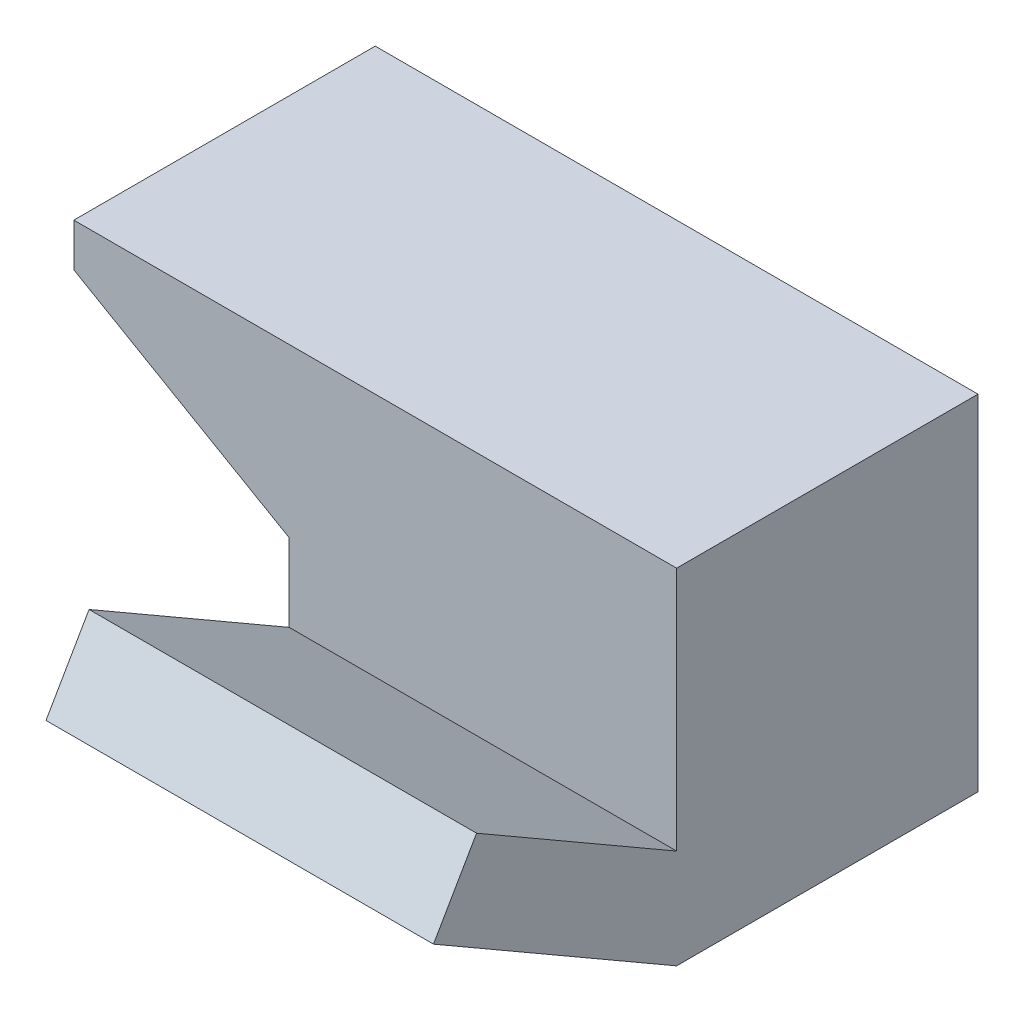
ISO-10303-21;
HEADER;
FILE_DESCRIPTION(('STEP AP214'),'2;1');
FILE_NAME('part.step','',(''),(''),'','','');
FILE_SCHEMA(('AUTOMOTIVE_DESIGN { 1 0 10303 214 1 1 1 1 }'));
ENDSEC;
DATA;
#1=APPLICATION_CONTEXT('core data for automotive mechanical design processes');
#2=APPLICATION_PROTOCOL_DEFINITION('international standard','automotive_design',2000,#1);
#3=PRODUCT_CONTEXT('',#1,'mechanical');
#4=PRODUCT('Part','Part','',(#3));
#5=PRODUCT_RELATED_PRODUCT_CATEGORY('part','',(#4));
#6=PRODUCT_DEFINITION_FORMATION('','',#4);
#7=PRODUCT_DEFINITION_CONTEXT('part definition',#1,'design');
#8=PRODUCT_DEFINITION('design','',#6,#7);
#9=PRODUCT_DEFINITION_SHAPE('','',#8);
#10=(LENGTH_UNIT() NAMED_UNIT(*) SI_UNIT(.MILLI.,.METRE.));
#11=(NAMED_UNIT(*) PLANE_ANGLE_UNIT() SI_UNIT($,.RADIAN.));
#12=(NAMED_UNIT(*) SI_UNIT($,.STERADIAN.) SOLID_ANGLE_UNIT());
#13=UNCERTAINTY_MEASURE_WITH_UNIT(LENGTH_MEASURE(1.E-05),#10,'distance_accuracy_value','');
#14=(GEOMETRIC_REPRESENTATION_CONTEXT(3) GLOBAL_UNCERTAINTY_ASSIGNED_CONTEXT((#13)) GLOBAL_UNIT_ASSIGNED_CONTEXT((#10,
#11,#12)) REPRESENTATION_CONTEXT('',''));
#15=CARTESIAN_POINT('',(0.,0.,0.));
#16=DIRECTION('',(0.,0.,1.));
#17=DIRECTION('',(1.,0.,0.));
#18=AXIS2_PLACEMENT_3D('',#15,#16,#17);
#19=CARTESIAN_POINT('',(88.8999999999999,65.5525918837419,-21.1025918837415));
#20=DIRECTION('',(-1.,0.,0.));
#21=DIRECTION('',(0.,-1.,0.));
#22=AXIS2_PLACEMENT_3D('',#19,#20,#21);
#23=PLANE('',#22);
#24=DIRECTION('',(0.,1.,0.));
#25=VECTOR('',#24,1.);
#26=CARTESIAN_POINT('',(88.9000000000001,65.552591883742,-65.5525918837415));
#27=LINE('',#26,#25);
#28=CARTESIAN_POINT('',(88.9000000000002,14.752591883742,-65.5525918837417));
#29=VERTEX_POINT('',#28);
#30=CARTESIAN_POINT('',(88.9000000000001,65.552591883742,-65.5525918837415));
#31=VERTEX_POINT('',#30);
#32=EDGE_CURVE('E137',#29,#31,#27,.T.);
#33=ORIENTED_EDGE('',*,*,#32,.T.);
#34=DIRECTION('',(0.,0.,-1.));
#35=VECTOR('',#34,1.);
#36=CARTESIAN_POINT('',(88.8999999999999,65.5525918837419,-21.1025918837415));
#37=LINE('',#36,#35);
#38=CARTESIAN_POINT('',(88.8999999999999,65.5525918837419,-21.1025918837415));
#39=VERTEX_POINT('',#38);
#40=EDGE_CURVE('E11',#39,#31,#37,.T.);
#41=ORIENTED_EDGE('',*,*,#40,.F.);
#42=DIRECTION('',(0.,1.,0.));
#43=VECTOR('',#42,1.);
#44=CARTESIAN_POINT('',(88.8999999999999,65.5525918837419,-21.1025918837415));
#45=LINE('',#44,#43);
#46=CARTESIAN_POINT('',(88.9,29.4172887211583,-21.1025918837416));
#47=VERTEX_POINT('',#46);
#48=EDGE_CURVE('E94',#47,#39,#45,.T.);
#49=ORIENTED_EDGE('',*,*,#48,.F.);
#50=DIRECTION('',(0.,0.499999999999992,0.866025403784444));
#51=VECTOR('',#50,1.);
#52=CARTESIAN_POINT('',(88.8999999999999,46.452114511804,8.40259188374198));
#53=LINE('',#52,#51);
#54=CARTESIAN_POINT('',(88.8999999999999,46.452114511804,8.40259188374198));
#55=VERTEX_POINT('',#54);
#56=EDGE_CURVE('E193',#47,#55,#53,.T.);
#57=ORIENTED_EDGE('',*,*,#56,.T.);
#58=DIRECTION('',(0.,-0.866025403784444,0.49999999999999));
#59=VECTOR('',#58,1.);
#60=CARTESIAN_POINT('',(88.8999999999999,35.4535918837415,14.7525918837419));
#61=LINE('',#60,#59);
#62=CARTESIAN_POINT('',(88.8999999999999,35.4535918837415,14.7525918837419));
#63=VERTEX_POINT('',#62);
#64=EDGE_CURVE('E197',#55,#63,#61,.T.);
#65=ORIENTED_EDGE('',*,*,#64,.T.);
#66=DIRECTION('',(0.,-0.499999999999992,-0.866025403784443));
#67=VECTOR('',#66,1.);
#68=CARTESIAN_POINT('',(88.9000000000001,14.7525918837419,-21.1025918837417));
#69=LINE('',#68,#67);
#70=CARTESIAN_POINT('',(88.9000000000001,14.7525918837419,-21.1025918837417));
#71=VERTEX_POINT('',#70);
#72=EDGE_CURVE('E202',#63,#71,#69,.T.);
#73=ORIENTED_EDGE('',*,*,#72,.T.);
#74=DIRECTION('',(0.,0.,-1.));
#75=VECTOR('',#74,1.);
#76=CARTESIAN_POINT('',(88.9000000000001,14.7525918837419,-21.1025918837417));
#77=LINE('',#76,#75);
#78=EDGE_CURVE('E62',#71,#29,#77,.T.);
#79=ORIENTED_EDGE('',*,*,#78,.T.);
#80=EDGE_LOOP('',(#33,#41,#49,#57,#65,#73,#79));
#81=FACE_BOUND('',#80,.T.);
#82=ADVANCED_FACE('F38',(#81),#23,.F.);
#83=CARTESIAN_POINT('',(31.7499999999999,65.5525918837417,-21.1025918837417));
#84=DIRECTION('',(0.,-1.,0.));
#85=DIRECTION('',(1.,0.,0.));
#86=AXIS2_PLACEMENT_3D('',#83,#84,#85);
#87=PLANE('',#86);
#88=DIRECTION('',(-1.,0.,0.));
#89=VECTOR('',#88,1.);
#90=CARTESIAN_POINT('',(31.7500000000001,65.5525918837418,-65.5525918837417));
#91=LINE('',#90,#89);
#92=CARTESIAN_POINT('',(0.,65.5525918837417,-65.5525918837418));
#93=VERTEX_POINT('',#92);
#94=EDGE_CURVE('E141',#31,#93,#91,.T.);
#95=ORIENTED_EDGE('',*,*,#94,.T.);
#96=DIRECTION('',(0.,0.,-1.));
#97=VECTOR('',#96,1.);
#98=CARTESIAN_POINT('',(0.,65.5525918837415,-21.1025918837418));
#99=LINE('',#98,#97);
#100=CARTESIAN_POINT('',(0.,65.5525918837415,-21.1025918837418));
#101=VERTEX_POINT('',#100);
#102=EDGE_CURVE('E46',#101,#93,#99,.T.);
#103=ORIENTED_EDGE('',*,*,#102,.F.);
#104=DIRECTION('',(-1.,0.,0.));
#105=VECTOR('',#104,1.);
#106=CARTESIAN_POINT('',(88.8999999999999,65.5525918837419,-21.1025918837415));
#107=LINE('',#106,#105);
#108=EDGE_CURVE('E219',#39,#101,#107,.T.);
#109=ORIENTED_EDGE('',*,*,#108,.F.);
#110=ORIENTED_EDGE('',*,*,#40,.T.);
#111=EDGE_LOOP('',(#95,#103,#109,#110));
#112=FACE_BOUND('',#111,.T.);
#113=ADVANCED_FACE('F223',(#112),#87,.F.);
#114=CARTESIAN_POINT('',(0.,65.5525918837415,-21.1025918837418));
#115=DIRECTION('',(1.,0.,0.));
#116=DIRECTION('',(0.,1.,0.));
#117=AXIS2_PLACEMENT_3D('',#114,#115,#116);
#118=PLANE('',#117);
#119=DIRECTION('',(0.,-1.,0.));
#120=VECTOR('',#119,1.);
#121=CARTESIAN_POINT('',(0.,65.5525918837417,-65.5525918837418));
#122=LINE('',#121,#120);
#123=CARTESIAN_POINT('',(0.,59.2025918837417,-65.5525918837418));
#124=VERTEX_POINT('',#123);
#125=EDGE_CURVE('E145',#93,#124,#122,.T.);
#126=ORIENTED_EDGE('',*,*,#125,.T.);
#127=DIRECTION('',(0.,0.,-1.));
#128=VECTOR('',#127,1.);
#129=CARTESIAN_POINT('',(0.,59.2025918837415,-21.1025918837418));
#130=LINE('',#129,#128);
#131=CARTESIAN_POINT('',(0.,59.2025918837415,-21.1025918837418));
#132=VERTEX_POINT('',#131);
#133=EDGE_CURVE('E122',#132,#124,#130,.T.);
#134=ORIENTED_EDGE('',*,*,#133,.F.);
#135=DIRECTION('',(0.,-1.,0.));
#136=VECTOR('',#135,1.);
#137=CARTESIAN_POINT('',(0.,65.5525918837415,-21.1025918837418));
#138=LINE('',#137,#136);
#139=EDGE_CURVE('E108',#101,#132,#138,.T.);
#140=ORIENTED_EDGE('',*,*,#139,.F.);
#141=ORIENTED_EDGE('',*,*,#102,.T.);
#142=EDGE_LOOP('',(#126,#134,#140,#141));
#143=FACE_BOUND('',#142,.T.);
#144=ADVANCED_FACE('F165',(#143),#118,.F.);
#145=CARTESIAN_POINT('',(0.,59.2025918837415,-21.1025918837418));
#146=DIRECTION('',(0.499999999999995,0.866025403784442,0.));
#147=DIRECTION('',(-0.866025403784442,0.499999999999995,0.));
#148=AXIS2_PLACEMENT_3D('',#145,#146,#147);
#149=PLANE('',#148);
#150=CARTESIAN_POINT('',(16.4977839420936,49.6775918837417,-43.2005918837418));
#151=DIRECTION('',(-0.499999999999995,-0.866025403784442,0.));
#152=DIRECTION('',(0.866025403784442,-0.499999999999995,0.));
#153=AXIS2_PLACEMENT_3D('',#150,#151,#152);
#154=CIRCLE('',#153,9.525);
#155=CARTESIAN_POINT('',(24.7466759131404,44.9150918837418,-43.2005918837418));
#156=VERTEX_POINT('',#155);
#157=EDGE_CURVE('E207',#156,#156,#154,.T.);
#158=ORIENTED_EDGE('',*,*,#157,.F.);
#159=EDGE_LOOP('',(#158));
#160=FACE_BOUND('',#159,.T.);
#161=DIRECTION('',(0.866025403784442,-0.499999999999995,0.));
#162=VECTOR('',#161,1.);
#163=CARTESIAN_POINT('',(0.,59.2025918837417,-65.5525918837418));
#164=LINE('',#163,#162);
#165=CARTESIAN_POINT('',(31.7500000000001,40.8717208369713,-65.5525918837418));
#166=VERTEX_POINT('',#165);
#167=EDGE_CURVE('E118',#124,#166,#164,.T.);
#168=ORIENTED_EDGE('',*,*,#167,.T.);
#169=DIRECTION('',(0.,0.,-1.));
#170=VECTOR('',#169,1.);
#171=CARTESIAN_POINT('',(31.75,40.8717208369711,-21.1025918837418));
#172=LINE('',#171,#170);
#173=CARTESIAN_POINT('',(31.75,40.8717208369711,-21.1025918837418));
#174=VERTEX_POINT('',#173);
#175=EDGE_CURVE('E115',#174,#166,#172,.T.);
#176=ORIENTED_EDGE('',*,*,#175,.F.);
#177=DIRECTION('',(0.866025403784442,-0.499999999999995,0.));
#178=VECTOR('',#177,1.);
#179=CARTESIAN_POINT('',(0.,59.2025918837415,-21.1025918837418));
#180=LINE('',#179,#178);
#181=EDGE_CURVE('E104',#132,#174,#180,.T.);
#182=ORIENTED_EDGE('',*,*,#181,.F.);
#183=ORIENTED_EDGE('',*,*,#133,.T.);
#184=EDGE_LOOP('',(#168,#176,#182,#183));
#185=FACE_BOUND('',#184,.T.);
#186=ADVANCED_FACE('F116',(#160,#185),#149,.F.);
#187=CARTESIAN_POINT('',(31.75,40.8717208369711,-21.1025918837418));
#188=DIRECTION('',(1.,0.,0.));
#189=DIRECTION('',(0.,1.,0.));
#190=AXIS2_PLACEMENT_3D('',#187,#188,#189);
#191=PLANE('',#190);
#192=DIRECTION('',(0.,-1.,0.));
#193=VECTOR('',#192,1.);
#194=CARTESIAN_POINT('',(31.7500000000001,40.8717208369713,-65.5525918837418));
#195=LINE('',#194,#193);
#196=CARTESIAN_POINT('',(31.7500000000002,14.7525918837418,-65.5525918837419));
#197=VERTEX_POINT('',#196);
#198=EDGE_CURVE('E150',#166,#197,#195,.T.);
#199=ORIENTED_EDGE('',*,*,#198,.T.);
#200=DIRECTION('',(0.,0.,-1.));
#201=VECTOR('',#200,1.);
#202=CARTESIAN_POINT('',(31.7500000000001,14.7525918837417,-21.1025918837419));
#203=LINE('',#202,#201);
#204=CARTESIAN_POINT('',(31.7500000000001,14.7525918837417,-21.1025918837419));
#205=VERTEX_POINT('',#204);
#206=EDGE_CURVE('E123',#205,#197,#203,.T.);
#207=ORIENTED_EDGE('',*,*,#206,.F.);
#208=DIRECTION('',(0.,-0.499999999999992,-0.866025403784443));
#209=VECTOR('',#208,1.);
#210=CARTESIAN_POINT('',(31.7500000000001,14.7525918837417,-21.1025918837419));
#211=LINE('',#210,#209);
#212=CARTESIAN_POINT('',(31.7499999999999,35.4535918837413,14.7525918837417));
#213=VERTEX_POINT('',#212);
#214=EDGE_CURVE('E177',#213,#205,#211,.T.);
#215=ORIENTED_EDGE('',*,*,#214,.F.);
#216=DIRECTION('',(0.,-0.866025403784444,0.49999999999999));
#217=VECTOR('',#216,1.);
#218=CARTESIAN_POINT('',(31.7499999999999,35.4535918837413,14.7525918837417));
#219=LINE('',#218,#217);
#220=CARTESIAN_POINT('',(31.7499999999999,46.4521145118038,8.40259188374179));
#221=VERTEX_POINT('',#220);
#222=EDGE_CURVE('E184',#221,#213,#219,.T.);
#223=ORIENTED_EDGE('',*,*,#222,.F.);
#224=DIRECTION('',(0.,0.499999999999992,0.866025403784444));
#225=VECTOR('',#224,1.);
#226=CARTESIAN_POINT('',(31.7499999999999,46.4521145118038,8.40259188374179));
#227=LINE('',#226,#225);
#228=CARTESIAN_POINT('',(31.75,29.4172887211581,-21.1025918837418));
#229=VERTEX_POINT('',#228);
#230=EDGE_CURVE('E129',#229,#221,#227,.T.);
#231=ORIENTED_EDGE('',*,*,#230,.F.);
#232=DIRECTION('',(0.,-1.,0.));
#233=VECTOR('',#232,1.);
#234=CARTESIAN_POINT('',(31.75,40.8717208369711,-21.1025918837418));
#235=LINE('',#234,#233);
#236=EDGE_CURVE('E53',#174,#229,#235,.T.);
#237=ORIENTED_EDGE('',*,*,#236,.F.);
#238=ORIENTED_EDGE('',*,*,#175,.T.);
#239=EDGE_LOOP('',(#199,#207,#215,#223,#231,#237,#238));
#240=FACE_BOUND('',#239,.T.);
#241=ADVANCED_FACE('F126',(#240),#191,.F.);
#242=CARTESIAN_POINT('',(88.9000000000001,14.7525918837419,-21.1025918837417));
#243=DIRECTION('',(0.,1.,0.));
#244=DIRECTION('',(-1.,0.,0.));
#245=AXIS2_PLACEMENT_3D('',#242,#243,#244);
#246=PLANE('',#245);
#247=CARTESIAN_POINT('',(47.7520000000004,14.7525918837418,-52.8525918837418));
#248=DIRECTION('',(0.,-1.,0.));
#249=DIRECTION('',(1.,0.,0.));
#250=AXIS2_PLACEMENT_3D('',#247,#248,#249);
#251=CIRCLE('',#250,4.7625);
#252=CARTESIAN_POINT('',(52.5145000000004,14.7525918837418,-52.8525918837418));
#253=VERTEX_POINT('',#252);
#254=EDGE_CURVE('E464',#253,#253,#251,.T.);
#255=ORIENTED_EDGE('',*,*,#254,.F.);
#256=EDGE_LOOP('',(#255));
#257=FACE_BOUND('',#256,.T.);
#258=CARTESIAN_POINT('',(72.8980000000002,14.7525918837419,-52.8525918837417));
#259=DIRECTION('',(0.,-1.,0.));
#260=DIRECTION('',(1.,0.,0.));
#261=AXIS2_PLACEMENT_3D('',#258,#259,#260);
#262=CIRCLE('',#261,4.7625000000002);
#263=CARTESIAN_POINT('',(77.6605000000004,14.7525918837419,-52.8525918837417));
#264=VERTEX_POINT('',#263);
#265=EDGE_CURVE('E463',#264,#264,#262,.T.);
#266=ORIENTED_EDGE('',*,*,#265,.F.);
#267=EDGE_LOOP('',(#266));
#268=FACE_BOUND('',#267,.T.);
#269=CARTESIAN_POINT('',(72.8980000000001,14.7525918837419,-33.8025918837417));
#270=DIRECTION('',(0.,-1.,0.));
#271=DIRECTION('',(1.,0.,0.));
#272=AXIS2_PLACEMENT_3D('',#269,#270,#271);
#273=CIRCLE('',#272,4.7625);
#274=CARTESIAN_POINT('',(77.6605000000001,14.7525918837419,-33.8025918837417));
#275=VERTEX_POINT('',#274);
#276=EDGE_CURVE('E494',#275,#275,#273,.T.);
#277=ORIENTED_EDGE('',*,*,#276,.F.);
#278=EDGE_LOOP('',(#277));
#279=FACE_BOUND('',#278,.T.);
#280=CARTESIAN_POINT('',(47.7520000000001,14.7525918837418,-33.8025918837418));
#281=DIRECTION('',(0.,-1.,0.));
#282=DIRECTION('',(1.,0.,0.));
#283=AXIS2_PLACEMENT_3D('',#280,#281,#282);
#284=CIRCLE('',#283,4.7625);
#285=CARTESIAN_POINT('',(52.5145000000001,14.7525918837418,-33.8025918837418));
#286=VERTEX_POINT('',#285);
#287=EDGE_CURVE('E480',#286,#286,#284,.T.);
#288=ORIENTED_EDGE('',*,*,#287,.F.);
#289=EDGE_LOOP('',(#288));
#290=FACE_BOUND('',#289,.T.);
#291=DIRECTION('',(1.,0.,0.));
#292=VECTOR('',#291,1.);
#293=CARTESIAN_POINT('',(88.9000000000002,14.752591883742,-65.5525918837417));
#294=LINE('',#293,#292);
#295=EDGE_CURVE('E88',#197,#29,#294,.T.);
#296=ORIENTED_EDGE('',*,*,#295,.T.);
#297=ORIENTED_EDGE('',*,*,#78,.F.);
#298=DIRECTION('',(1.,0.,0.));
#299=VECTOR('',#298,1.);
#300=CARTESIAN_POINT('',(88.9000000000001,14.7525918837419,-21.1025918837417));
#301=LINE('',#300,#299);
#302=EDGE_CURVE('E131',#205,#71,#301,.T.);
#303=ORIENTED_EDGE('',*,*,#302,.F.);
#304=ORIENTED_EDGE('',*,*,#206,.T.);
#305=EDGE_LOOP('',(#296,#297,#303,#304));
#306=FACE_BOUND('',#305,.T.);
#307=ADVANCED_FACE('F171',(#257,#268,#279,#290,#306),#246,.F.);
#308=CARTESIAN_POINT('',(88.8999999999999,65.5525918837419,-21.1025918837415));
#309=DIRECTION('',(0.,0.,-1.));
#310=DIRECTION('',(0.,-1.,0.));
#311=AXIS2_PLACEMENT_3D('',#308,#309,#310);
#312=PLANE('',#311);
#313=ORIENTED_EDGE('',*,*,#236,.T.);
#314=DIRECTION('',(1.,0.,0.));
#315=VECTOR('',#314,1.);
#316=CARTESIAN_POINT('',(31.75,29.4172887211581,-21.1025918837418));
#317=LINE('',#316,#315);
#318=EDGE_CURVE('E183',#229,#47,#317,.T.);
#319=ORIENTED_EDGE('',*,*,#318,.T.);
#320=ORIENTED_EDGE('',*,*,#48,.T.);
#321=ORIENTED_EDGE('',*,*,#108,.T.);
#322=ORIENTED_EDGE('',*,*,#139,.T.);
#323=ORIENTED_EDGE('',*,*,#181,.T.);
#324=EDGE_LOOP('',(#313,#319,#320,#321,#322,#323));
#325=FACE_BOUND('',#324,.T.);
#326=ADVANCED_FACE('F106',(#325),#312,.F.);
#327=CARTESIAN_POINT('',(88.9000000000001,65.552591883742,-65.5525918837415));
#328=DIRECTION('',(0.,0.,-1.));
#329=DIRECTION('',(0.,-1.,0.));
#330=AXIS2_PLACEMENT_3D('',#327,#328,#329);
#331=PLANE('',#330);
#332=ORIENTED_EDGE('',*,*,#198,.F.);
#333=ORIENTED_EDGE('',*,*,#167,.F.);
#334=ORIENTED_EDGE('',*,*,#125,.F.);
#335=ORIENTED_EDGE('',*,*,#94,.F.);
#336=ORIENTED_EDGE('',*,*,#32,.F.);
#337=ORIENTED_EDGE('',*,*,#295,.F.);
#338=EDGE_LOOP('',(#332,#333,#334,#335,#336,#337));
#339=FACE_BOUND('',#338,.T.);
#340=ADVANCED_FACE('F168',(#339),#331,.T.);
#341=CARTESIAN_POINT('',(19.6727839420936,55.1768531977729,-43.2005918837418));
#342=DIRECTION('',(-0.499999999999995,-0.866025403784442,0.));
#343=DIRECTION('',(0.866025403784442,-0.499999999999995,0.));
#344=AXIS2_PLACEMENT_3D('',#341,#342,#343);
#345=CYLINDRICAL_SURFACE('',#344,9.525);
#346=CARTESIAN_POINT('',(19.6727839420936,55.1768531977729,-43.2005918837418));
#347=DIRECTION('',(-0.499999999999995,-0.866025403784442,0.));
#348=DIRECTION('',(0.866025403784442,-0.499999999999995,0.));
#349=AXIS2_PLACEMENT_3D('',#346,#347,#348);
#350=CIRCLE('',#349,9.525);
#351=CARTESIAN_POINT('',(27.9216759131404,50.414353197773,-43.2005918837417));
#352=VERTEX_POINT('',#351);
#353=EDGE_CURVE('E142',#352,#352,#350,.T.);
#354=ORIENTED_EDGE('',*,*,#353,.F.);
#355=EDGE_LOOP('',(#354));
#356=FACE_BOUND('',#355,.T.);
#357=ORIENTED_EDGE('',*,*,#157,.T.);
#358=EDGE_LOOP('',(#357));
#359=FACE_BOUND('',#358,.T.);
#360=ADVANCED_FACE('F268',(#356,#359),#345,.F.);
#361=CARTESIAN_POINT('',(19.6727839420936,55.1768531977729,-43.2005918837418));
#362=DIRECTION('',(-0.499999999999995,-0.866025403784442,0.));
#363=DIRECTION('',(0.866025403784442,-0.499999999999995,0.));
#364=AXIS2_PLACEMENT_3D('',#361,#362,#363);
#365=PLANE('',#364);
#366=ORIENTED_EDGE('',*,*,#353,.T.);
#367=EDGE_LOOP('',(#366));
#368=FACE_BOUND('',#367,.T.);
#369=ADVANCED_FACE('F246',(#368),#365,.T.);
#370=CARTESIAN_POINT('',(31.7500000000001,14.7525918837417,-21.1025918837419));
#371=DIRECTION('',(0.,-0.866025403784443,0.499999999999992));
#372=DIRECTION('',(0.,0.499999999999992,0.866025403784443));
#373=AXIS2_PLACEMENT_3D('',#370,#371,#372);
#374=PLANE('',#373);
#375=CARTESIAN_POINT('',(60.198,25.9285918837416,-1.74519205835186));
#376=DIRECTION('',(0.,-0.866025403784443,0.499999999999992));
#377=DIRECTION('',(0.,0.499999999999992,0.866025403784443));
#378=AXIS2_PLACEMENT_3D('',#375,#376,#377);
#379=CIRCLE('',#378,9.525);
#380=CARTESIAN_POINT('',(60.1979999999999,30.6910918837415,6.50369991269497));
#381=VERTEX_POINT('',#380);
#382=EDGE_CURVE('E479',#381,#381,#379,.T.);
#383=ORIENTED_EDGE('',*,*,#382,.F.);
#384=EDGE_LOOP('',(#383));
#385=FACE_BOUND('',#384,.T.);
#386=ORIENTED_EDGE('',*,*,#72,.F.);
#387=DIRECTION('',(1.,0.,0.));
#388=VECTOR('',#387,1.);
#389=CARTESIAN_POINT('',(31.7499999999999,35.4535918837413,14.7525918837417));
#390=LINE('',#389,#388);
#391=EDGE_CURVE('E180',#213,#63,#390,.T.);
#392=ORIENTED_EDGE('',*,*,#391,.F.);
#393=ORIENTED_EDGE('',*,*,#214,.T.);
#394=ORIENTED_EDGE('',*,*,#302,.T.);
#395=EDGE_LOOP('',(#386,#392,#393,#394));
#396=FACE_BOUND('',#395,.T.);
#397=ADVANCED_FACE('F178',(#385,#396),#374,.T.);
#398=CARTESIAN_POINT('',(31.7499999999999,35.4535918837413,14.7525918837417));
#399=DIRECTION('',(0.,0.49999999999999,0.866025403784444));
#400=DIRECTION('',(0.,0.866025403784444,-0.49999999999999));
#401=AXIS2_PLACEMENT_3D('',#398,#399,#400);
#402=PLANE('',#401);
#403=ORIENTED_EDGE('',*,*,#64,.F.);
#404=DIRECTION('',(1.,0.,0.));
#405=VECTOR('',#404,1.);
#406=CARTESIAN_POINT('',(31.7499999999999,46.4521145118038,8.40259188374179));
#407=LINE('',#406,#405);
#408=EDGE_CURVE('E188',#221,#55,#407,.T.);
#409=ORIENTED_EDGE('',*,*,#408,.F.);
#410=ORIENTED_EDGE('',*,*,#222,.T.);
#411=ORIENTED_EDGE('',*,*,#391,.T.);
#412=EDGE_LOOP('',(#403,#409,#410,#411));
#413=FACE_BOUND('',#412,.T.);
#414=ADVANCED_FACE('F237',(#413),#402,.T.);
#415=CARTESIAN_POINT('',(31.7499999999999,46.4521145118038,8.40259188374179));
#416=DIRECTION('',(0.,0.866025403784444,-0.499999999999992));
#417=DIRECTION('',(0.,-0.499999999999992,-0.866025403784444));
#418=AXIS2_PLACEMENT_3D('',#415,#416,#417);
#419=PLANE('',#418);
#420=ORIENTED_EDGE('',*,*,#56,.F.);
#421=ORIENTED_EDGE('',*,*,#318,.F.);
#422=ORIENTED_EDGE('',*,*,#230,.T.);
#423=ORIENTED_EDGE('',*,*,#408,.T.);
#424=EDGE_LOOP('',(#420,#421,#422,#423));
#425=FACE_BOUND('',#424,.T.);
#426=ADVANCED_FACE('F236',(#425),#419,.T.);
#427=CARTESIAN_POINT('',(60.198,31.4278531977728,-4.92019205835181));
#428=DIRECTION('',(0.,-0.866025403784443,0.499999999999992));
#429=DIRECTION('',(0.,0.499999999999992,0.866025403784444));
#430=AXIS2_PLACEMENT_3D('',#427,#428,#429);
#431=CYLINDRICAL_SURFACE('',#430,9.525);
#432=CARTESIAN_POINT('',(60.198,31.4278531977728,-4.92019205835181));
#433=DIRECTION('',(0.,-0.866025403784443,0.499999999999992));
#434=DIRECTION('',(0.,0.499999999999992,0.866025403784443));
#435=AXIS2_PLACEMENT_3D('',#432,#433,#434);
#436=CIRCLE('',#435,9.525);
#437=CARTESIAN_POINT('',(60.1979999999999,36.1903531977727,3.32869991269502));
#438=VERTEX_POINT('',#437);
#439=EDGE_CURVE('E198',#438,#438,#436,.T.);
#440=ORIENTED_EDGE('',*,*,#439,.F.);
#441=EDGE_LOOP('',(#440));
#442=FACE_BOUND('',#441,.T.);
#443=ORIENTED_EDGE('',*,*,#382,.T.);
#444=EDGE_LOOP('',(#443));
#445=FACE_BOUND('',#444,.T.);
#446=ADVANCED_FACE('F244',(#442,#445),#431,.F.);
#447=CARTESIAN_POINT('',(60.198,31.4278531977728,-4.92019205835181));
#448=DIRECTION('',(0.,-0.866025403784443,0.499999999999992));
#449=DIRECTION('',(0.,0.499999999999992,0.866025403784443));
#450=AXIS2_PLACEMENT_3D('',#447,#448,#449);
#451=PLANE('',#450);
#452=ORIENTED_EDGE('',*,*,#439,.T.);
#453=EDGE_LOOP('',(#452));
#454=FACE_BOUND('',#453,.T.);
#455=ADVANCED_FACE('F365',(#454),#451,.T.);
#456=CARTESIAN_POINT('',(47.7520000000001,27.4525918837418,-33.8025918837418));
#457=DIRECTION('',(0.,-1.,0.));
#458=DIRECTION('',(1.,0.,0.));
#459=AXIS2_PLACEMENT_3D('',#456,#457,#458);
#460=CYLINDRICAL_SURFACE('',#459,4.7625);
#461=CARTESIAN_POINT('',(47.7520000000001,27.4525918837418,-33.8025918837418));
#462=DIRECTION('',(0.,-1.,0.));
#463=DIRECTION('',(1.,0.,0.));
#464=AXIS2_PLACEMENT_3D('',#461,#462,#463);
#465=CIRCLE('',#464,4.7625);
#466=CARTESIAN_POINT('',(52.5145000000001,27.4525918837418,-33.8025918837417));
#467=VERTEX_POINT('',#466);
#468=EDGE_CURVE('E475',#467,#467,#465,.T.);
#469=ORIENTED_EDGE('',*,*,#468,.F.);
#470=EDGE_LOOP('',(#469));
#471=FACE_BOUND('',#470,.T.);
#472=ORIENTED_EDGE('',*,*,#287,.T.);
#473=EDGE_LOOP('',(#472));
#474=FACE_BOUND('',#473,.T.);
#475=ADVANCED_FACE('F373',(#471,#474),#460,.F.);
#476=CARTESIAN_POINT('',(47.7520000000001,27.4525918837418,-33.8025918837418));
#477=DIRECTION('',(0.,-1.,0.));
#478=DIRECTION('',(1.,0.,0.));
#479=AXIS2_PLACEMENT_3D('',#476,#477,#478);
#480=PLANE('',#479);
#481=ORIENTED_EDGE('',*,*,#468,.T.);
#482=EDGE_LOOP('',(#481));
#483=FACE_BOUND('',#482,.T.);
#484=ADVANCED_FACE('F382',(#483),#480,.T.);
#485=CARTESIAN_POINT('',(72.8980000000001,27.4525918837419,-33.8025918837417));
#486=DIRECTION('',(0.,-1.,0.));
#487=DIRECTION('',(1.,0.,0.));
#488=AXIS2_PLACEMENT_3D('',#485,#486,#487);
#489=CYLINDRICAL_SURFACE('',#488,4.7625);
#490=CARTESIAN_POINT('',(72.8980000000001,27.4525918837419,-33.8025918837417));
#491=DIRECTION('',(0.,-1.,0.));
#492=DIRECTION('',(1.,0.,0.));
#493=AXIS2_PLACEMENT_3D('',#490,#491,#492);
#494=CIRCLE('',#493,4.7625);
#495=CARTESIAN_POINT('',(77.6605000000001,27.4525918837419,-33.8025918837416));
#496=VERTEX_POINT('',#495);
#497=EDGE_CURVE('E484',#496,#496,#494,.T.);
#498=ORIENTED_EDGE('',*,*,#497,.F.);
#499=EDGE_LOOP('',(#498));
#500=FACE_BOUND('',#499,.T.);
#501=ORIENTED_EDGE('',*,*,#276,.T.);
#502=EDGE_LOOP('',(#501));
#503=FACE_BOUND('',#502,.T.);
#504=ADVANCED_FACE('F391',(#500,#503),#489,.F.);
#505=CARTESIAN_POINT('',(72.8980000000001,27.4525918837419,-33.8025918837417));
#506=DIRECTION('',(0.,-1.,0.));
#507=DIRECTION('',(1.,0.,0.));
#508=AXIS2_PLACEMENT_3D('',#505,#506,#507);
#509=PLANE('',#508);
#510=ORIENTED_EDGE('',*,*,#497,.T.);
#511=EDGE_LOOP('',(#510));
#512=FACE_BOUND('',#511,.T.);
#513=ADVANCED_FACE('F400',(#512),#509,.T.);
#514=CARTESIAN_POINT('',(72.8980000000002,27.4525918837419,-52.8525918837417));
#515=DIRECTION('',(0.,-1.,0.));
#516=DIRECTION('',(1.,0.,0.));
#517=AXIS2_PLACEMENT_3D('',#514,#515,#516);
#518=CYLINDRICAL_SURFACE('',#517,4.7625000000002);
#519=CARTESIAN_POINT('',(72.8980000000002,27.4525918837419,-52.8525918837417));
#520=DIRECTION('',(0.,-1.,0.));
#521=DIRECTION('',(1.,0.,0.));
#522=AXIS2_PLACEMENT_3D('',#519,#520,#521);
#523=CIRCLE('',#522,4.7625000000002);
#524=CARTESIAN_POINT('',(77.6605000000004,27.4525918837419,-52.8525918837417));
#525=VERTEX_POINT('',#524);
#526=EDGE_CURVE('E469',#525,#525,#523,.T.);
#527=ORIENTED_EDGE('',*,*,#526,.F.);
#528=EDGE_LOOP('',(#527));
#529=FACE_BOUND('',#528,.T.);
#530=ORIENTED_EDGE('',*,*,#265,.T.);
#531=EDGE_LOOP('',(#530));
#532=FACE_BOUND('',#531,.T.);
#533=ADVANCED_FACE('F409',(#529,#532),#518,.F.);
#534=CARTESIAN_POINT('',(72.8980000000002,27.4525918837419,-52.8525918837417));
#535=DIRECTION('',(0.,-1.,0.));
#536=DIRECTION('',(1.,0.,0.));
#537=AXIS2_PLACEMENT_3D('',#534,#535,#536);
#538=PLANE('',#537);
#539=ORIENTED_EDGE('',*,*,#526,.T.);
#540=EDGE_LOOP('',(#539));
#541=FACE_BOUND('',#540,.T.);
#542=ADVANCED_FACE('F418',(#541),#538,.T.);
#543=CARTESIAN_POINT('',(47.7520000000004,27.4525918837418,-52.8525918837418));
#544=DIRECTION('',(0.,-1.,0.));
#545=DIRECTION('',(1.,0.,0.));
#546=AXIS2_PLACEMENT_3D('',#543,#544,#545);
#547=CYLINDRICAL_SURFACE('',#546,4.7625);
#548=CARTESIAN_POINT('',(47.7520000000004,27.4525918837418,-52.8525918837418));
#549=DIRECTION('',(0.,-1.,0.));
#550=DIRECTION('',(1.,0.,0.));
#551=AXIS2_PLACEMENT_3D('',#548,#549,#550);
#552=CIRCLE('',#551,4.7625);
#553=CARTESIAN_POINT('',(52.5145000000004,27.4525918837418,-52.8525918837417));
#554=VERTEX_POINT('',#553);
#555=EDGE_CURVE('E461',#554,#554,#552,.T.);
#556=ORIENTED_EDGE('',*,*,#555,.F.);
#557=EDGE_LOOP('',(#556));
#558=FACE_BOUND('',#557,.T.);
#559=ORIENTED_EDGE('',*,*,#254,.T.);
#560=EDGE_LOOP('',(#559));
#561=FACE_BOUND('',#560,.T.);
#562=ADVANCED_FACE('F427',(#558,#561),#547,.F.);
#563=CARTESIAN_POINT('',(47.7520000000004,27.4525918837418,-52.8525918837418));
#564=DIRECTION('',(0.,-1.,0.));
#565=DIRECTION('',(1.,0.,0.));
#566=AXIS2_PLACEMENT_3D('',#563,#564,#565);
#567=PLANE('',#566);
#568=ORIENTED_EDGE('',*,*,#555,.T.);
#569=EDGE_LOOP('',(#568));
#570=FACE_BOUND('',#569,.T.);
#571=ADVANCED_FACE('F436',(#570),#567,.T.);
#572=CLOSED_SHELL('',(#82,#113,#144,#186,#241,#307,#326,#340,#360,#369,#397,#414,#426,#446,#455,
#475,#484,#504,#513,#533,#542,#562,#571));
#573=MANIFOLD_SOLID_BREP('B2',#572);
#574=ADVANCED_BREP_SHAPE_REPRESENTATION('',(#18,#573),#14);
#575=SHAPE_DEFINITION_REPRESENTATION(#9,#574);
ENDSEC;
END-ISO-10303-21;
